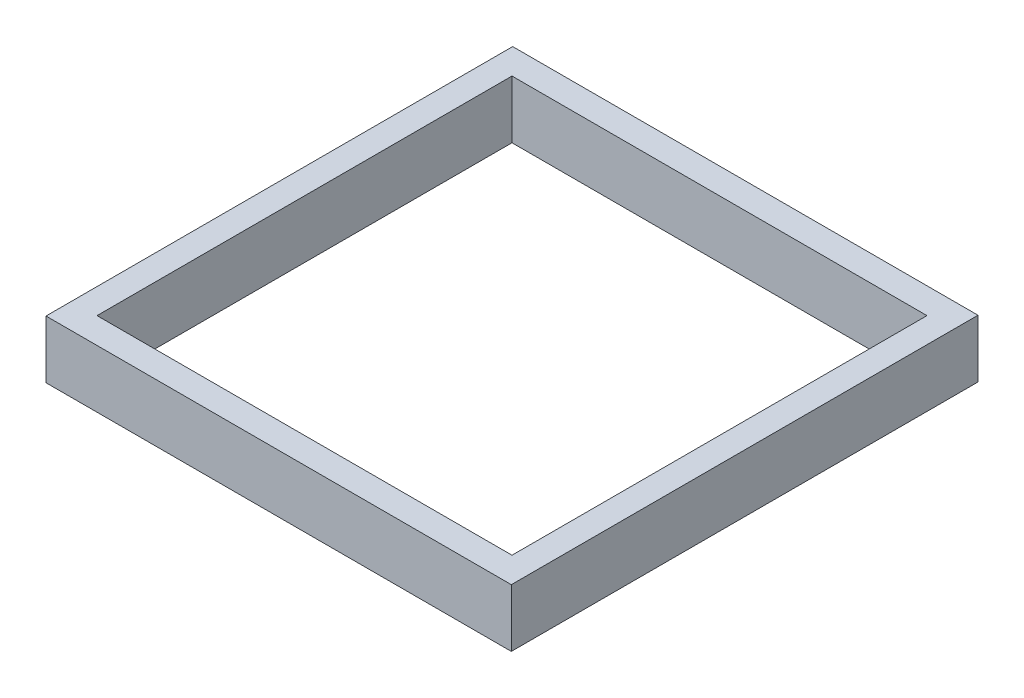
ISO-10303-21;
HEADER;
FILE_DESCRIPTION(('STEP AP214'),'2;1');
FILE_NAME('part.step','',(''),(''),'','','');
FILE_SCHEMA(('AUTOMOTIVE_DESIGN { 1 0 10303 214 1 1 1 1 }'));
ENDSEC;
DATA;
#1=APPLICATION_CONTEXT('core data for automotive mechanical design processes');
#2=APPLICATION_PROTOCOL_DEFINITION('international standard','automotive_design',2000,#1);
#3=PRODUCT_CONTEXT('',#1,'mechanical');
#4=PRODUCT('Part','Part','',(#3));
#5=PRODUCT_RELATED_PRODUCT_CATEGORY('part','',(#4));
#6=PRODUCT_DEFINITION_FORMATION('','',#4);
#7=PRODUCT_DEFINITION_CONTEXT('part definition',#1,'design');
#8=PRODUCT_DEFINITION('design','',#6,#7);
#9=PRODUCT_DEFINITION_SHAPE('','',#8);
#10=(LENGTH_UNIT() NAMED_UNIT(*) SI_UNIT(.MILLI.,.METRE.));
#11=(NAMED_UNIT(*) PLANE_ANGLE_UNIT() SI_UNIT($,.RADIAN.));
#12=(NAMED_UNIT(*) SI_UNIT($,.STERADIAN.) SOLID_ANGLE_UNIT());
#13=UNCERTAINTY_MEASURE_WITH_UNIT(LENGTH_MEASURE(1.E-05),#10,'distance_accuracy_value','');
#14=(GEOMETRIC_REPRESENTATION_CONTEXT(3) GLOBAL_UNCERTAINTY_ASSIGNED_CONTEXT((#13)) GLOBAL_UNIT_ASSIGNED_CONTEXT((#10,
#11,#12)) REPRESENTATION_CONTEXT('',''));
#15=CARTESIAN_POINT('',(0.,0.,0.));
#16=DIRECTION('',(0.,0.,1.));
#17=DIRECTION('',(1.,0.,0.));
#18=AXIS2_PLACEMENT_3D('',#15,#16,#17);
#19=CARTESIAN_POINT('',(0.,0.,686.));
#20=DIRECTION('',(1.,0.,0.));
#21=DIRECTION('',(0.,1.,0.));
#22=AXIS2_PLACEMENT_3D('',#19,#20,#21);
#23=PLANE('',#22);
#24=DIRECTION('',(0.,-1.,0.));
#25=VECTOR('',#24,1.);
#26=CARTESIAN_POINT('',(0.,0.,38.));
#27=LINE('',#26,#25);
#28=CARTESIAN_POINT('',(0.,85.,38.));
#29=VERTEX_POINT('',#28);
#30=CARTESIAN_POINT('',(0.,0.,38.));
#31=VERTEX_POINT('',#30);
#32=EDGE_CURVE('E47',#29,#31,#27,.T.);
#33=ORIENTED_EDGE('',*,*,#32,.T.);
#34=DIRECTION('',(0.,0.,-1.));
#35=VECTOR('',#34,1.);
#36=CARTESIAN_POINT('',(0.,0.,686.));
#37=LINE('',#36,#35);
#38=CARTESIAN_POINT('',(0.,0.,648.));
#39=VERTEX_POINT('',#38);
#40=EDGE_CURVE('E11',#39,#31,#37,.T.);
#41=ORIENTED_EDGE('',*,*,#40,.F.);
#42=DIRECTION('',(0.,1.,0.));
#43=VECTOR('',#42,1.);
#44=CARTESIAN_POINT('',(0.,0.,648.));
#45=LINE('',#44,#43);
#46=CARTESIAN_POINT('',(0.,85.,648.));
#47=VERTEX_POINT('',#46);
#48=EDGE_CURVE('E135',#39,#47,#45,.T.);
#49=ORIENTED_EDGE('',*,*,#48,.T.);
#50=DIRECTION('',(0.,0.,-1.));
#51=VECTOR('',#50,1.);
#52=CARTESIAN_POINT('',(0.,85.,686.));
#53=LINE('',#52,#51);
#54=EDGE_CURVE('E51',#47,#29,#53,.T.);
#55=ORIENTED_EDGE('',*,*,#54,.T.);
#56=EDGE_LOOP('',(#33,#41,#49,#55));
#57=FACE_BOUND('',#56,.T.);
#58=ADVANCED_FACE('F33',(#57),#23,.F.);
#59=CARTESIAN_POINT('',(-610.,0.,686.));
#60=DIRECTION('',(-1.,0.,0.));
#61=DIRECTION('',(0.,0.,1.));
#62=AXIS2_PLACEMENT_3D('',#59,#60,#61);
#63=PLANE('',#62);
#64=DIRECTION('',(0.,-1.,0.));
#65=VECTOR('',#64,1.);
#66=CARTESIAN_POINT('',(-610.,0.,38.));
#67=LINE('',#66,#65);
#68=CARTESIAN_POINT('',(-610.,85.,38.));
#69=VERTEX_POINT('',#68);
#70=CARTESIAN_POINT('',(-610.,0.,37.9999999999999));
#71=VERTEX_POINT('',#70);
#72=EDGE_CURVE('E176',#69,#71,#67,.T.);
#73=ORIENTED_EDGE('',*,*,#72,.F.);
#74=DIRECTION('',(0.,0.,-1.));
#75=VECTOR('',#74,1.);
#76=CARTESIAN_POINT('',(-610.,85.,686.));
#77=LINE('',#76,#75);
#78=CARTESIAN_POINT('',(-610.,85.,648.));
#79=VERTEX_POINT('',#78);
#80=EDGE_CURVE('E117',#79,#69,#77,.T.);
#81=ORIENTED_EDGE('',*,*,#80,.F.);
#82=DIRECTION('',(0.,1.,0.));
#83=VECTOR('',#82,1.);
#84=CARTESIAN_POINT('',(-610.,0.,648.));
#85=LINE('',#84,#83);
#86=CARTESIAN_POINT('',(-610.,0.,648.));
#87=VERTEX_POINT('',#86);
#88=EDGE_CURVE('E134',#87,#79,#85,.T.);
#89=ORIENTED_EDGE('',*,*,#88,.F.);
#90=DIRECTION('',(0.,0.,-1.));
#91=VECTOR('',#90,1.);
#92=CARTESIAN_POINT('',(-610.,0.,686.));
#93=LINE('',#92,#91);
#94=EDGE_CURVE('E122',#87,#71,#93,.T.);
#95=ORIENTED_EDGE('',*,*,#94,.T.);
#96=EDGE_LOOP('',(#73,#81,#89,#95));
#97=FACE_BOUND('',#96,.T.);
#98=ADVANCED_FACE('F166',(#97),#63,.F.);
#99=CARTESIAN_POINT('',(0.,0.,686.));
#100=DIRECTION('',(0.,1.,0.));
#101=DIRECTION('',(0.,0.,1.));
#102=AXIS2_PLACEMENT_3D('',#99,#100,#101);
#103=PLANE('',#102);
#104=DIRECTION('',(0.,0.,-1.));
#105=VECTOR('',#104,1.);
#106=CARTESIAN_POINT('',(-647.,0.,686.));
#107=LINE('',#106,#105);
#108=CARTESIAN_POINT('',(-647.,0.,686.));
#109=VERTEX_POINT('',#108);
#110=CARTESIAN_POINT('',(-647.,0.,0.));
#111=VERTEX_POINT('',#110);
#112=EDGE_CURVE('E118',#109,#111,#107,.T.);
#113=ORIENTED_EDGE('',*,*,#112,.T.);
#114=DIRECTION('',(1.,0.,0.));
#115=VECTOR('',#114,1.);
#116=CARTESIAN_POINT('',(0.,0.,0.));
#117=LINE('',#116,#115);
#118=CARTESIAN_POINT('',(37.,0.,0.));
#119=VERTEX_POINT('',#118);
#120=EDGE_CURVE('E145',#111,#119,#117,.T.);
#121=ORIENTED_EDGE('',*,*,#120,.T.);
#122=DIRECTION('',(0.,0.,-1.));
#123=VECTOR('',#122,1.);
#124=CARTESIAN_POINT('',(37.,0.,686.));
#125=LINE('',#124,#123);
#126=CARTESIAN_POINT('',(37.,0.,686.));
#127=VERTEX_POINT('',#126);
#128=EDGE_CURVE('E40',#127,#119,#125,.T.);
#129=ORIENTED_EDGE('',*,*,#128,.F.);
#130=DIRECTION('',(1.,0.,0.));
#131=VECTOR('',#130,1.);
#132=CARTESIAN_POINT('',(0.,0.,686.));
#133=LINE('',#132,#131);
#134=EDGE_CURVE('E146',#109,#127,#133,.T.);
#135=ORIENTED_EDGE('',*,*,#134,.F.);
#136=EDGE_LOOP('',(#113,#121,#129,#135));
#137=FACE_BOUND('',#136,.T.);
#138=ORIENTED_EDGE('',*,*,#40,.T.);
#139=DIRECTION('',(-1.,0.,0.));
#140=VECTOR('',#139,1.);
#141=CARTESIAN_POINT('',(0.,0.,38.));
#142=LINE('',#141,#140);
#143=EDGE_CURVE('E170',#31,#71,#142,.T.);
#144=ORIENTED_EDGE('',*,*,#143,.T.);
#145=ORIENTED_EDGE('',*,*,#94,.F.);
#146=DIRECTION('',(-1.,0.,0.));
#147=VECTOR('',#146,1.);
#148=CARTESIAN_POINT('',(0.,0.,648.));
#149=LINE('',#148,#147);
#150=EDGE_CURVE('E142',#39,#87,#149,.T.);
#151=ORIENTED_EDGE('',*,*,#150,.F.);
#152=EDGE_LOOP('',(#138,#144,#145,#151));
#153=FACE_BOUND('',#152,.T.);
#154=ADVANCED_FACE('F163',(#137,#153),#103,.F.);
#155=CARTESIAN_POINT('',(37.,0.,686.));
#156=DIRECTION('',(-1.,0.,0.));
#157=DIRECTION('',(0.,-1.,0.));
#158=AXIS2_PLACEMENT_3D('',#155,#156,#157);
#159=PLANE('',#158);
#160=DIRECTION('',(0.,1.,0.));
#161=VECTOR('',#160,1.);
#162=CARTESIAN_POINT('',(37.,0.,0.));
#163=LINE('',#162,#161);
#164=CARTESIAN_POINT('',(37.,85.,0.));
#165=VERTEX_POINT('',#164);
#166=EDGE_CURVE('E150',#119,#165,#163,.T.);
#167=ORIENTED_EDGE('',*,*,#166,.T.);
#168=DIRECTION('',(0.,0.,-1.));
#169=VECTOR('',#168,1.);
#170=CARTESIAN_POINT('',(37.,85.,686.));
#171=LINE('',#170,#169);
#172=CARTESIAN_POINT('',(37.,85.,686.));
#173=VERTEX_POINT('',#172);
#174=EDGE_CURVE('E154',#173,#165,#171,.T.);
#175=ORIENTED_EDGE('',*,*,#174,.F.);
#176=DIRECTION('',(0.,1.,0.));
#177=VECTOR('',#176,1.);
#178=CARTESIAN_POINT('',(37.,0.,686.));
#179=LINE('',#178,#177);
#180=EDGE_CURVE('E104',#127,#173,#179,.T.);
#181=ORIENTED_EDGE('',*,*,#180,.F.);
#182=ORIENTED_EDGE('',*,*,#128,.T.);
#183=EDGE_LOOP('',(#167,#175,#181,#182));
#184=FACE_BOUND('',#183,.T.);
#185=ADVANCED_FACE('F159',(#184),#159,.F.);
#186=CARTESIAN_POINT('',(0.,85.,686.));
#187=DIRECTION('',(0.,-1.,0.));
#188=DIRECTION('',(0.,0.,-1.));
#189=AXIS2_PLACEMENT_3D('',#186,#187,#188);
#190=PLANE('',#189);
#191=DIRECTION('',(-1.,0.,0.));
#192=VECTOR('',#191,1.);
#193=CARTESIAN_POINT('',(0.,85.,38.));
#194=LINE('',#193,#192);
#195=EDGE_CURVE('E126',#29,#69,#194,.T.);
#196=ORIENTED_EDGE('',*,*,#195,.F.);
#197=ORIENTED_EDGE('',*,*,#54,.F.);
#198=DIRECTION('',(-1.,0.,0.));
#199=VECTOR('',#198,1.);
#200=CARTESIAN_POINT('',(0.,85.,648.));
#201=LINE('',#200,#199);
#202=EDGE_CURVE('E137',#47,#79,#201,.T.);
#203=ORIENTED_EDGE('',*,*,#202,.T.);
#204=ORIENTED_EDGE('',*,*,#80,.T.);
#205=EDGE_LOOP('',(#196,#197,#203,#204));
#206=FACE_BOUND('',#205,.T.);
#207=DIRECTION('',(-1.,0.,0.));
#208=VECTOR('',#207,1.);
#209=CARTESIAN_POINT('',(0.,85.,0.));
#210=LINE('',#209,#208);
#211=CARTESIAN_POINT('',(-647.,85.,0.));
#212=VERTEX_POINT('',#211);
#213=EDGE_CURVE('E113',#165,#212,#210,.T.);
#214=ORIENTED_EDGE('',*,*,#213,.T.);
#215=DIRECTION('',(0.,0.,-1.));
#216=VECTOR('',#215,1.);
#217=CARTESIAN_POINT('',(-647.,85.,686.));
#218=LINE('',#217,#216);
#219=CARTESIAN_POINT('',(-647.,85.,686.));
#220=VERTEX_POINT('',#219);
#221=EDGE_CURVE('E110',#220,#212,#218,.T.);
#222=ORIENTED_EDGE('',*,*,#221,.F.);
#223=DIRECTION('',(-1.,0.,0.));
#224=VECTOR('',#223,1.);
#225=CARTESIAN_POINT('',(0.,85.,686.));
#226=LINE('',#225,#224);
#227=EDGE_CURVE('E97',#173,#220,#226,.T.);
#228=ORIENTED_EDGE('',*,*,#227,.F.);
#229=ORIENTED_EDGE('',*,*,#174,.T.);
#230=EDGE_LOOP('',(#214,#222,#228,#229));
#231=FACE_BOUND('',#230,.T.);
#232=ADVANCED_FACE('F111',(#206,#231),#190,.F.);
#233=CARTESIAN_POINT('',(0.,0.,686.));
#234=DIRECTION('',(0.,0.,-1.));
#235=DIRECTION('',(-1.,0.,0.));
#236=AXIS2_PLACEMENT_3D('',#233,#234,#235);
#237=PLANE('',#236);
#238=ORIENTED_EDGE('',*,*,#227,.T.);
#239=DIRECTION('',(0.,-1.,0.));
#240=VECTOR('',#239,1.);
#241=CARTESIAN_POINT('',(-647.,0.,686.));
#242=LINE('',#241,#240);
#243=EDGE_CURVE('E101',#220,#109,#242,.T.);
#244=ORIENTED_EDGE('',*,*,#243,.T.);
#245=ORIENTED_EDGE('',*,*,#134,.T.);
#246=ORIENTED_EDGE('',*,*,#180,.T.);
#247=EDGE_LOOP('',(#238,#244,#245,#246));
#248=FACE_BOUND('',#247,.T.);
#249=ADVANCED_FACE('F99',(#248),#237,.F.);
#250=CARTESIAN_POINT('',(0.,0.,0.));
#251=DIRECTION('',(0.,0.,-1.));
#252=DIRECTION('',(-1.,0.,0.));
#253=AXIS2_PLACEMENT_3D('',#250,#251,#252);
#254=PLANE('',#253);
#255=ORIENTED_EDGE('',*,*,#120,.F.);
#256=DIRECTION('',(0.,-1.,0.));
#257=VECTOR('',#256,1.);
#258=CARTESIAN_POINT('',(-647.,0.,0.));
#259=LINE('',#258,#257);
#260=EDGE_CURVE('E123',#212,#111,#259,.T.);
#261=ORIENTED_EDGE('',*,*,#260,.F.);
#262=ORIENTED_EDGE('',*,*,#213,.F.);
#263=ORIENTED_EDGE('',*,*,#166,.F.);
#264=EDGE_LOOP('',(#255,#261,#262,#263));
#265=FACE_BOUND('',#264,.T.);
#266=ADVANCED_FACE('F162',(#265),#254,.T.);
#267=CARTESIAN_POINT('',(0.,0.,648.));
#268=DIRECTION('',(0.,0.,1.));
#269=DIRECTION('',(1.,0.,0.));
#270=AXIS2_PLACEMENT_3D('',#267,#268,#269);
#271=PLANE('',#270);
#272=ORIENTED_EDGE('',*,*,#88,.T.);
#273=ORIENTED_EDGE('',*,*,#202,.F.);
#274=ORIENTED_EDGE('',*,*,#48,.F.);
#275=ORIENTED_EDGE('',*,*,#150,.T.);
#276=EDGE_LOOP('',(#272,#273,#274,#275));
#277=FACE_BOUND('',#276,.T.);
#278=ADVANCED_FACE('F182',(#277),#271,.F.);
#279=CARTESIAN_POINT('',(-647.,0.,686.));
#280=DIRECTION('',(1.,0.,0.));
#281=DIRECTION('',(0.,0.,-1.));
#282=AXIS2_PLACEMENT_3D('',#279,#280,#281);
#283=PLANE('',#282);
#284=ORIENTED_EDGE('',*,*,#260,.T.);
#285=ORIENTED_EDGE('',*,*,#112,.F.);
#286=ORIENTED_EDGE('',*,*,#243,.F.);
#287=ORIENTED_EDGE('',*,*,#221,.T.);
#288=EDGE_LOOP('',(#284,#285,#286,#287));
#289=FACE_BOUND('',#288,.T.);
#290=ADVANCED_FACE('F120',(#289),#283,.F.);
#291=CARTESIAN_POINT('',(0.,0.,38.));
#292=DIRECTION('',(0.,0.,-1.));
#293=DIRECTION('',(0.,1.,0.));
#294=AXIS2_PLACEMENT_3D('',#291,#292,#293);
#295=PLANE('',#294);
#296=ORIENTED_EDGE('',*,*,#72,.T.);
#297=ORIENTED_EDGE('',*,*,#143,.F.);
#298=ORIENTED_EDGE('',*,*,#32,.F.);
#299=ORIENTED_EDGE('',*,*,#195,.T.);
#300=EDGE_LOOP('',(#296,#297,#298,#299));
#301=FACE_BOUND('',#300,.T.);
#302=ADVANCED_FACE('F174',(#301),#295,.F.);
#303=CLOSED_SHELL('',(#58,#98,#154,#185,#232,#249,#266,#278,#290,#302));
#304=MANIFOLD_SOLID_BREP('B2',#303);
#305=ADVANCED_BREP_SHAPE_REPRESENTATION('',(#18,#304),#14);
#306=SHAPE_DEFINITION_REPRESENTATION(#9,#305);
ENDSEC;
END-ISO-10303-21;
